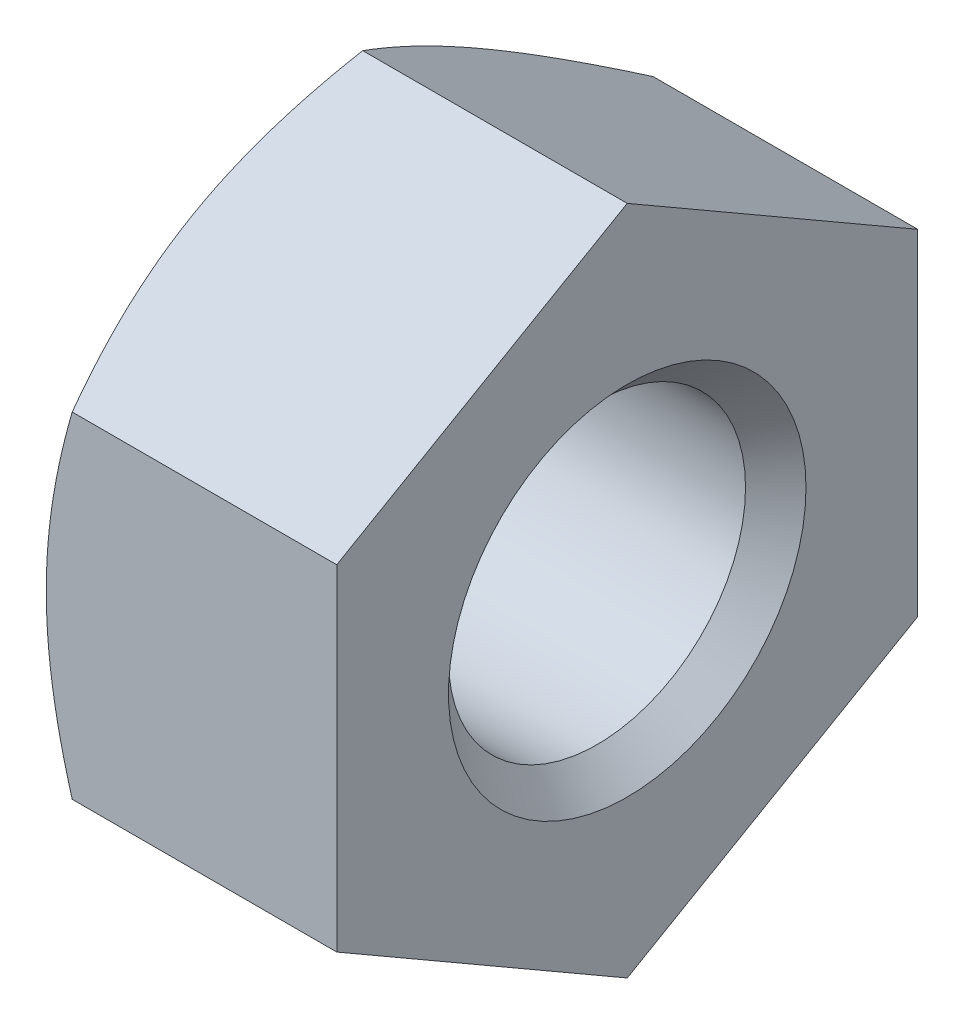
ISO-10303-21;
HEADER;
FILE_DESCRIPTION(('STEP AP214'),'2;1');
FILE_NAME('part.step','',(''),(''),'','','');
FILE_SCHEMA(('AUTOMOTIVE_DESIGN { 1 0 10303 214 1 1 1 1 }'));
ENDSEC;
DATA;
#1=APPLICATION_CONTEXT('core data for automotive mechanical design processes');
#2=APPLICATION_PROTOCOL_DEFINITION('international standard','automotive_design',2000,#1);
#3=PRODUCT_CONTEXT('',#1,'mechanical');
#4=PRODUCT('Part','Part','',(#3));
#5=PRODUCT_RELATED_PRODUCT_CATEGORY('part','',(#4));
#6=PRODUCT_DEFINITION_FORMATION('','',#4);
#7=PRODUCT_DEFINITION_CONTEXT('part definition',#1,'design');
#8=PRODUCT_DEFINITION('design','',#6,#7);
#9=PRODUCT_DEFINITION_SHAPE('','',#8);
#10=(LENGTH_UNIT() NAMED_UNIT(*) SI_UNIT(.MILLI.,.METRE.));
#11=(NAMED_UNIT(*) PLANE_ANGLE_UNIT() SI_UNIT($,.RADIAN.));
#12=(NAMED_UNIT(*) SI_UNIT($,.STERADIAN.) SOLID_ANGLE_UNIT());
#13=UNCERTAINTY_MEASURE_WITH_UNIT(LENGTH_MEASURE(1.E-05),#10,'distance_accuracy_value','');
#14=(GEOMETRIC_REPRESENTATION_CONTEXT(3) GLOBAL_UNCERTAINTY_ASSIGNED_CONTEXT((#13)) GLOBAL_UNIT_ASSIGNED_CONTEXT((#10,
#11,#12)) REPRESENTATION_CONTEXT('',''));
#15=CARTESIAN_POINT('',(0.,0.,0.));
#16=DIRECTION('',(0.,0.,1.));
#17=DIRECTION('',(1.,0.,0.));
#18=AXIS2_PLACEMENT_3D('',#15,#16,#17);
#19=CARTESIAN_POINT('',(8.5,-3.75277674973257,-6.5));
#20=DIRECTION('',(0.,0.,1.));
#21=DIRECTION('',(1.,0.,0.));
#22=AXIS2_PLACEMENT_3D('',#19,#20,#21);
#23=PLANE('',#22);
#24=CARTESIAN_POINT('',(-1.09282119696695E-11,0.,-6.5000000000021));
#25=CARTESIAN_POINT('',(-2.65652654537331E-05,-0.159284316480109,-6.50000000000076));
#26=CARTESIAN_POINT('',(0.00337972743862408,-0.318560959695347,-6.5000000000002));
#27=CARTESIAN_POINT('',(0.0168605822240665,-0.63680150419193,-6.4999999999998));
#28=CARTESIAN_POINT('',(0.0269338241987751,-0.79576546113901,-6.49999999999995));
#29=CARTESIAN_POINT('',(0.0534847991494171,-1.11235385212824,-6.50000000000005));
#30=CARTESIAN_POINT('',(0.0699302904864636,-1.26998101093723,-6.50000000000002));
#31=CARTESIAN_POINT('',(0.108872015365523,-1.58448433827285,-6.49999999999999));
#32=CARTESIAN_POINT('',(0.13136840817184,-1.7413604869217,-6.5));
#33=CARTESIAN_POINT('',(0.207238966047529,-2.21021215299385,-6.50000000000001));
#34=CARTESIAN_POINT('',(0.269031351182337,-2.52082563881242,-6.50000000000001));
#35=CARTESIAN_POINT('',(0.411540396382836,-3.13938147094162,-6.5));
#36=CARTESIAN_POINT('',(0.492351567542897,-3.44730224146836,-6.49999999999999));
#37=CARTESIAN_POINT('',(0.580556558563613,-3.75277666310649,-6.5));
#38=B_SPLINE_CURVE_WITH_KNOTS('',3,(#24,#25,#26,#27,#28,#29,#30,#31,#32,#33,#34,#35,#36,#37),
.UNSPECIFIED.,.F.,.F.,(4,2,2,2,2,2,4),(0.,0.477804183678231,0.955513786787722,1.4308372393377,
1.90617320398505,2.85559928787532,3.80984692116775),.UNSPECIFIED.);
#39=CARTESIAN_POINT('',(-4.85698309760928E-12,0.,-6.50000000000841));
#40=VERTEX_POINT('',#39);
#41=CARTESIAN_POINT('',(0.580556571067009,-3.75277670641953,-6.5));
#42=VERTEX_POINT('',#41);
#43=EDGE_CURVE('E202',#40,#42,#38,.T.);
#44=ORIENTED_EDGE('',*,*,#43,.F.);
#45=CARTESIAN_POINT('',(0.580556593192645,3.75277678306498,-6.5));
#46=CARTESIAN_POINT('',(0.49235159733905,3.4473023519739,-6.5));
#47=CARTESIAN_POINT('',(0.411540421570641,3.13938157184442,-6.5));
#48=CARTESIAN_POINT('',(0.269031368037173,2.52082572032325,-6.5));
#49=CARTESIAN_POINT('',(0.207238979169166,2.21021222471798,-6.5));
#50=CARTESIAN_POINT('',(0.131368416601329,1.74136054370656,-6.5));
#51=CARTESIAN_POINT('',(0.108872022380726,1.5844843900214,-6.5));
#52=CARTESIAN_POINT('',(0.069930295030884,1.26998105254583,-6.5));
#53=CARTESIAN_POINT('',(0.0534848026373018,1.11235388863321,-6.5));
#54=CARTESIAN_POINT('',(0.0269338259670412,0.795765487323537,-6.5));
#55=CARTESIAN_POINT('',(0.016860583332727,0.636801525159254,-6.5));
#56=CARTESIAN_POINT('',(0.00337972766151993,0.318560970195728,-6.5));
#57=CARTESIAN_POINT('',(-2.65652684605192E-05,0.159284321730737,-6.5));
#58=CARTESIAN_POINT('',(-9.71393821965785E-12,-3.50872316609123E-13,-6.5));
#59=B_SPLINE_CURVE_WITH_KNOTS('',3,(#45,#46,#47,#48,#49,#50,#51,#52,#53,#54,#55,#56,#57,#58),
.UNSPECIFIED.,.F.,.F.,(4,2,2,2,2,2,4),(0.,0.954247664608512,1.90367377943597,2.37900975963217,
2.85433322772826,3.33204284656971,3.80984704599525),.UNSPECIFIED.);
#60=CARTESIAN_POINT('',(0.580556571066926,3.75277677138924,-6.49999996248956));
#61=VERTEX_POINT('',#60);
#62=EDGE_CURVE('E151',#61,#40,#59,.T.);
#63=ORIENTED_EDGE('',*,*,#62,.F.);
#64=DIRECTION('',(1.,0.,0.));
#65=VECTOR('',#64,1.);
#66=CARTESIAN_POINT('',(8.5,3.75277674973257,-6.5));
#67=LINE('',#66,#65);
#68=CARTESIAN_POINT('',(6.5,3.75277674973257,-6.5));
#69=VERTEX_POINT('',#68);
#70=EDGE_CURVE('E98',#61,#69,#67,.T.);
#71=ORIENTED_EDGE('',*,*,#70,.T.);
#72=DIRECTION('',(0.,1.,0.));
#73=VECTOR('',#72,1.);
#74=CARTESIAN_POINT('',(6.5,9.1,-6.5));
#75=LINE('',#74,#73);
#76=CARTESIAN_POINT('',(6.5,-3.75277674973257,-6.5));
#77=VERTEX_POINT('',#76);
#78=EDGE_CURVE('E126',#69,#77,#75,.F.);
#79=ORIENTED_EDGE('',*,*,#78,.T.);
#80=DIRECTION('',(1.,0.,0.));
#81=VECTOR('',#80,1.);
#82=CARTESIAN_POINT('',(8.5,-3.75277674973256,-6.5));
#83=LINE('',#82,#81);
#84=EDGE_CURVE('E277',#77,#42,#83,.F.);
#85=ORIENTED_EDGE('',*,*,#84,.T.);
#86=EDGE_LOOP('',(#44,#63,#71,#79,#85));
#87=FACE_BOUND('',#86,.T.);
#88=ADVANCED_FACE('F18',(#87),#23,.F.);
#89=CARTESIAN_POINT('',(8.5,-7.50555349946513,0.));
#90=DIRECTION('',(0.,0.866025403784439,0.5));
#91=DIRECTION('',(0.,-0.5,0.866025403784439));
#92=AXIS2_PLACEMENT_3D('',#89,#90,#91);
#93=PLANE('',#92);
#94=CARTESIAN_POINT('',(-1.09314266979679E-11,-5.62916512460067,-3.25000000000105));
#95=CARTESIAN_POINT('',(-2.65652654571899E-05,-5.70880728284038,-3.11205573550273));
#96=CARTESIAN_POINT('',(0.00337972743869159,-5.78844560444835,-2.97411811624712));
#97=CARTESIAN_POINT('',(0.0168605822244118,-5.94756587669793,-2.69851372019583));
#98=CARTESIAN_POINT('',(0.0269338241993273,-6.02704785517242,-2.56084689519222));
#99=CARTESIAN_POINT('',(0.0534847991505099,-6.18534205066875,-2.28667330604956));
#100=CARTESIAN_POINT('',(0.0699302904878891,-6.26415563007401,-2.1501641821932));
#101=CARTESIAN_POINT('',(0.108872015367726,-6.42140729374339,-1.87779631114304));
#102=CARTESIAN_POINT('',(0.131368408174487,-6.49984536806862,-1.7419375811639));
#103=CARTESIAN_POINT('',(0.207238966051651,-6.73427120110705,-1.33590012773471));
#104=CARTESIAN_POINT('',(0.269031351187632,-6.88957794401787,-1.06690095825512));
#105=CARTESIAN_POINT('',(0.411540396390751,-7.19885586008551,-0.531215893966927));
#106=CARTESIAN_POINT('',(0.492351567552261,-7.35281624535039,-0.264548684335271));
#107=CARTESIAN_POINT('',(0.580556558574496,-7.50555345617095,-7.49877248903251E-08));
#108=B_SPLINE_CURVE_WITH_KNOTS('',3,(#94,#95,#96,#97,#98,#99,#100,#101,#102,#103,#104,#105,#106,
#107),.UNSPECIFIED.,.F.,.F.,(4,2,2,2,2,2,4),(0.,0.477804183683182,0.955513786797618,
1.43083723935248,1.90617320400472,2.85559928790472,3.80984692120699),.UNSPECIFIED.);
#109=CARTESIAN_POINT('',(-4.85826822472909E-12,-5.62916512460613,-3.25000000000421));
#110=VERTEX_POINT('',#109);
#111=CARTESIAN_POINT('',(0.580556571072286,-7.50555347781775,-3.74943592194856E-08));
#112=VERTEX_POINT('',#111);
#113=EDGE_CURVE('E86',#110,#112,#108,.T.);
#114=ORIENTED_EDGE('',*,*,#113,.F.);
#115=CARTESIAN_POINT('',(0.580556593192473,-3.75277673306665,-6.5000000288662));
#116=CARTESIAN_POINT('',(0.492351597338902,-3.90551394861217,-6.23545141133477));
#117=CARTESIAN_POINT('',(0.411540421570515,-4.05947433867689,-5.96878419338956));
#118=CARTESIAN_POINT('',(0.269031368037089,-4.36875226443742,-5.43309911231279));
#119=CARTESIAN_POINT('',(0.2072389791691,-4.52405901224003,-5.16409993436038));
#120=CARTESIAN_POINT('',(0.131368416601285,-4.75848485274571,-4.75806246799752));
#121=CARTESIAN_POINT('',(0.108872022380689,-4.83692292958827,-4.6222037336582));
#122=CARTESIAN_POINT('',(0.0699302950308591,-4.99417459832603,-4.34983585382941));
#123=CARTESIAN_POINT('',(0.0534848026372821,-5.07298818028233,-4.21332672555461));
#124=CARTESIAN_POINT('',(0.0269338259670299,-5.23128238093714,-3.93915312747697));
#125=CARTESIAN_POINT('',(0.0168605833327189,-5.31076436201927,-3.8014862979565));
#126=CARTESIAN_POINT('',(0.00337972766151615,-5.46988463950101,-3.52588189284367));
#127=CARTESIAN_POINT('',(-2.65652684631201E-05,-5.54952296373349,-3.38794426904337));
#128=CARTESIAN_POINT('',(-9.7162860636917E-12,-5.62916512459902,-3.2499999999997));
#129=B_SPLINE_CURVE_WITH_KNOTS('',3,(#115,#116,#117,#118,#119,#120,#121,#122,#123,#124,#125,
#126,#127,#128),.UNSPECIFIED.,.F.,.F.,(4,2,2,2,2,2,4),(0.,0.95424766460836,1.90367377943567,
2.37900975963179,2.8543332277278,3.33204284656917,3.80984704599463),.UNSPECIFIED.);
#130=EDGE_CURVE('E162',#42,#110,#129,.T.);
#131=ORIENTED_EDGE('',*,*,#130,.F.);
#132=ORIENTED_EDGE('',*,*,#84,.F.);
#133=DIRECTION('',(0.,-0.499999999999999,0.866025403784439));
#134=VECTOR('',#133,1.);
#135=CARTESIAN_POINT('',(6.5,-3.75277674973257,-6.5));
#136=LINE('',#135,#134);
#137=CARTESIAN_POINT('',(6.5,-7.50555349946513,0.));
#138=VERTEX_POINT('',#137);
#139=EDGE_CURVE('E292',#77,#138,#136,.T.);
#140=ORIENTED_EDGE('',*,*,#139,.T.);
#141=DIRECTION('',(1.,0.,0.));
#142=VECTOR('',#141,1.);
#143=CARTESIAN_POINT('',(8.5,-7.50555349946514,0.));
#144=LINE('',#143,#142);
#145=EDGE_CURVE('E273',#138,#112,#144,.F.);
#146=ORIENTED_EDGE('',*,*,#145,.T.);
#147=EDGE_LOOP('',(#114,#131,#132,#140,#146));
#148=FACE_BOUND('',#147,.T.);
#149=ADVANCED_FACE('F192',(#148),#93,.F.);
#150=CARTESIAN_POINT('',(8.5,-3.75277674973257,6.5));
#151=DIRECTION('',(0.,0.866025403784439,-0.5));
#152=DIRECTION('',(0.,0.5,0.866025403784439));
#153=AXIS2_PLACEMENT_3D('',#150,#151,#152);
#154=PLANE('',#153);
#155=CARTESIAN_POINT('',(-1.09269197541718E-11,-5.62916512460067,3.25000000000106));
#156=CARTESIAN_POINT('',(-2.65652654522853E-05,-5.54952296635947,3.38794426449657));
#157=CARTESIAN_POINT('',(0.00337972743862405,-5.46988464475138,3.52588188375017));
#158=CARTESIAN_POINT('',(0.0168605822240608,-5.31076437250277,3.80148627979815));
#159=CARTESIAN_POINT('',(0.0269338241987652,-5.23128239402938,3.93915310480046));
#160=CARTESIAN_POINT('',(0.0534847991493968,-5.07298819853489,4.21332669394037));
#161=CARTESIAN_POINT('',(0.0699302904864369,-4.99417461913038,4.34983581779527));
#162=CARTESIAN_POINT('',(0.108872015365481,-4.83692295546257,4.62220368884259));
#163=CARTESIAN_POINT('',(0.13136840817179,-4.75848488113817,4.75806241882034));
#164=CARTESIAN_POINT('',(0.207238966047451,-4.52405904810215,5.1640998722454));
#165=CARTESIAN_POINT('',(0.269031351182236,-4.36875230519289,5.43309904172227));
#166=CARTESIAN_POINT('',(0.411540396382685,-4.05947438912834,5.96878410600507));
#167=CARTESIAN_POINT('',(0.492351567542718,-3.905514003865,6.23545131563406));
#168=CARTESIAN_POINT('',(0.580556558563405,-3.75277679304597,6.49999992497899));
#169=B_SPLINE_CURVE_WITH_KNOTS('',3,(#155,#156,#157,#158,#159,#160,#161,#162,#163,#164,#165,
#166,#167,#168),.UNSPECIFIED.,.F.,.F.,(4,2,2,2,2,2,4),(0.,0.477804183678136,0.955513786787531,
1.43083723933742,1.90617320398467,2.85559928787475,3.80984692116699),.UNSPECIFIED.);
#170=CARTESIAN_POINT('',(-4.85667693640149E-12,-5.62916512460613,3.25000000000421));
#171=VERTEX_POINT('',#170);
#172=CARTESIAN_POINT('',(0.580556571066906,-3.75277677138927,6.4999999624895));
#173=VERTEX_POINT('',#172);
#174=EDGE_CURVE('E82',#171,#173,#169,.T.);
#175=ORIENTED_EDGE('',*,*,#174,.F.);
#176=CARTESIAN_POINT('',(0.580556593194509,-7.50555351613457,-2.88723034796803E-08));
#177=CARTESIAN_POINT('',(0.492351597340654,-7.35281630058878,0.264548588659608));
#178=CARTESIAN_POINT('',(0.411540421571996,-7.19885591052378,0.531215806605311));
#179=CARTESIAN_POINT('',(0.26903136803808,-6.88957798476267,1.06690088768306));
#180=CARTESIAN_POINT('',(0.207238979169872,-6.73427123695977,1.33590006563597));
#181=CARTESIAN_POINT('',(0.131368416601783,-6.49984539645366,1.7419375319996));
#182=CARTESIAN_POINT('',(0.108872022381103,-6.42140731961095,1.87779626633917));
#183=CARTESIAN_POINT('',(0.0699302950311286,-6.26415565087289,2.15016414616847));
#184=CARTESIAN_POINT('',(0.0534848026374896,-6.18534206891644,2.28667327444353));
#185=CARTESIAN_POINT('',(0.0269338259671367,-6.02704786826132,2.5608468725217));
#186=CARTESIAN_POINT('',(0.0168605833327872,-5.94756588717904,2.69851370204244));
#187=CARTESIAN_POINT('',(0.00337972766153246,-5.788445609697,2.9741181071558));
#188=CARTESIAN_POINT('',(-2.65652684601394E-05,-5.70880728546436,3.11205573095637));
#189=CARTESIAN_POINT('',(-9.71335387280296E-12,-5.62916512459867,3.25000000000031));
#190=B_SPLINE_CURVE_WITH_KNOTS('',3,(#176,#177,#178,#179,#180,#181,#182,#183,#184,#185,#186,
#187,#188,#189),.UNSPECIFIED.,.F.,.F.,(4,2,2,2,2,2,4),(0.,0.954247664610198,1.90367377943932,
2.37900975963636,2.85433322773328,3.33204284657558,3.80984704600197),.UNSPECIFIED.);
#191=EDGE_CURVE('E198',#112,#171,#190,.T.);
#192=ORIENTED_EDGE('',*,*,#191,.F.);
#193=ORIENTED_EDGE('',*,*,#145,.F.);
#194=DIRECTION('',(0.,0.499999999999999,0.866025403784439));
#195=VECTOR('',#194,1.);
#196=CARTESIAN_POINT('',(6.5,-7.50555349946513,0.));
#197=LINE('',#196,#195);
#198=CARTESIAN_POINT('',(6.5,-3.75277674973257,6.5));
#199=VERTEX_POINT('',#198);
#200=EDGE_CURVE('E271',#138,#199,#197,.T.);
#201=ORIENTED_EDGE('',*,*,#200,.T.);
#202=DIRECTION('',(-1.,0.,0.));
#203=VECTOR('',#202,1.);
#204=CARTESIAN_POINT('',(8.5,-3.75277674973257,6.5));
#205=LINE('',#204,#203);
#206=EDGE_CURVE('E268',#199,#173,#205,.T.);
#207=ORIENTED_EDGE('',*,*,#206,.T.);
#208=EDGE_LOOP('',(#175,#192,#193,#201,#207));
#209=FACE_BOUND('',#208,.T.);
#210=ADVANCED_FACE('F189',(#209),#154,.F.);
#211=CARTESIAN_POINT('',(8.5,3.75277674973257,6.5));
#212=DIRECTION('',(0.,0.,-1.));
#213=DIRECTION('',(-1.,0.,0.));
#214=AXIS2_PLACEMENT_3D('',#211,#212,#213);
#215=PLANE('',#214);
#216=CARTESIAN_POINT('',(-1.09282119696695E-11,0.,6.5000000000021));
#217=CARTESIAN_POINT('',(-2.65652654538492E-05,0.15928431648001,6.50000000000076));
#218=CARTESIAN_POINT('',(0.00337972743861955,0.318560959695149,6.5000000000002));
#219=CARTESIAN_POINT('',(0.016860582224045,0.636801504191534,6.4999999999998));
#220=CARTESIAN_POINT('',(0.0269338241987413,0.795765461138516,6.49999999999995));
#221=CARTESIAN_POINT('',(0.0534847991493509,1.11235385212755,6.50000000000005));
#222=CARTESIAN_POINT('',(0.0699302904863776,1.26998101093644,6.50000000000002));
#223=CARTESIAN_POINT('',(0.10887201536539,1.58448433827188,6.49999999999999));
#224=CARTESIAN_POINT('',(0.131368408171681,1.74136048692063,6.5));
#225=CARTESIAN_POINT('',(0.207238966047282,2.2102121529925,6.50000000000001));
#226=CARTESIAN_POINT('',(0.269031351182019,2.52082563881088,6.50000000000001));
#227=CARTESIAN_POINT('',(0.411540396382361,3.13938147093971,6.5));
#228=CARTESIAN_POINT('',(0.492351567542335,3.44730224146628,6.49999999999999));
#229=CARTESIAN_POINT('',(0.580556558562959,3.75277666310423,6.5));
#230=B_SPLINE_CURVE_WITH_KNOTS('',3,(#216,#217,#218,#219,#220,#221,#222,#223,#224,#225,#226,
#227,#228,#229),.UNSPECIFIED.,.F.,.F.,(4,2,2,2,2,2,4),(0.,0.477804183677934,0.955513786787128,
1.43083723933681,1.90617320398387,2.85559928787356,3.80984692116539),.UNSPECIFIED.);
#231=CARTESIAN_POINT('',(-4.85698309760928E-12,0.,6.50000000000841));
#232=VERTEX_POINT('',#231);
#233=CARTESIAN_POINT('',(0.580556571066774,3.75277670641871,6.5));
#234=VERTEX_POINT('',#233);
#235=EDGE_CURVE('E22',#232,#234,#230,.T.);
#236=ORIENTED_EDGE('',*,*,#235,.F.);
#237=CARTESIAN_POINT('',(0.580556593192685,-3.75277678306512,6.5));
#238=CARTESIAN_POINT('',(0.492351597339085,-3.44730235197403,6.5));
#239=CARTESIAN_POINT('',(0.41154042157067,-3.13938157184454,6.5));
#240=CARTESIAN_POINT('',(0.269031368037193,-2.52082572032334,6.5));
#241=CARTESIAN_POINT('',(0.207238979169182,-2.21021222471806,6.5));
#242=CARTESIAN_POINT('',(0.131368416601339,-1.74136054370662,6.5));
#243=CARTESIAN_POINT('',(0.108872022380734,-1.58448439002146,6.5));
#244=CARTESIAN_POINT('',(0.069930295030889,-1.26998105254588,6.5));
#245=CARTESIAN_POINT('',(0.0534848026373056,-1.11235388863325,6.5));
#246=CARTESIAN_POINT('',(0.0269338259670432,-0.795765487323567,6.5));
#247=CARTESIAN_POINT('',(0.0168605833327284,-0.636801525159277,6.5));
#248=CARTESIAN_POINT('',(0.00337972766152036,-0.318560970195739,6.5));
#249=CARTESIAN_POINT('',(-2.65652684603681E-05,-0.159284321730742,6.5));
#250=CARTESIAN_POINT('',(-9.71399645317338E-12,3.51718926058685E-13,6.5));
#251=B_SPLINE_CURVE_WITH_KNOTS('',3,(#237,#238,#239,#240,#241,#242,#243,#244,#245,#246,#247,
#248,#249,#250),.UNSPECIFIED.,.F.,.F.,(4,2,2,2,2,2,4),(0.,0.954247664608549,1.90367377943605,
2.37900975963226,2.85433322772837,3.33204284656984,3.80984704599539),.UNSPECIFIED.);
#252=EDGE_CURVE('E76',#173,#232,#251,.T.);
#253=ORIENTED_EDGE('',*,*,#252,.F.);
#254=ORIENTED_EDGE('',*,*,#206,.F.);
#255=DIRECTION('',(0.,1.,0.));
#256=VECTOR('',#255,1.);
#257=CARTESIAN_POINT('',(6.5,9.1,6.5));
#258=LINE('',#257,#256);
#259=CARTESIAN_POINT('',(6.5,3.75277674973257,6.5));
#260=VERTEX_POINT('',#259);
#261=EDGE_CURVE('E299',#199,#260,#258,.T.);
#262=ORIENTED_EDGE('',*,*,#261,.T.);
#263=DIRECTION('',(1.,0.,0.));
#264=VECTOR('',#263,1.);
#265=CARTESIAN_POINT('',(8.5,3.75277674973256,6.5));
#266=LINE('',#265,#264);
#267=EDGE_CURVE('E93',#260,#234,#266,.F.);
#268=ORIENTED_EDGE('',*,*,#267,.T.);
#269=EDGE_LOOP('',(#236,#253,#254,#262,#268));
#270=FACE_BOUND('',#269,.T.);
#271=ADVANCED_FACE('F90',(#270),#215,.F.);
#272=CARTESIAN_POINT('',(8.5,7.50555349946513,0.));
#273=DIRECTION('',(0.,-0.866025403784439,-0.5));
#274=DIRECTION('',(0.,0.5,-0.866025403784439));
#275=AXIS2_PLACEMENT_3D('',#272,#273,#274);
#276=PLANE('',#275);
#277=CARTESIAN_POINT('',(-1.09316144872928E-11,5.62916512460067,3.25000000000105));
#278=CARTESIAN_POINT('',(-2.65652688950295E-05,5.70880728546523,3.11205573095636));
#279=CARTESIAN_POINT('',(0.00337972766142582,5.78844560969744,2.97411810715543));
#280=CARTESIAN_POINT('',(0.0168605833329407,5.94756588717923,2.69851370204169));
#281=CARTESIAN_POINT('',(0.0269338259672226,6.0270478682617,2.56084687252093));
#282=CARTESIAN_POINT('',(0.0534848026375586,6.18534206891702,2.28667327444262));
#283=CARTESIAN_POINT('',(0.069930295031248,6.26415565087349,2.15016414616744));
#284=CARTESIAN_POINT('',(0.108872022381303,6.42140731961164,1.87779626633792));
#285=CARTESIAN_POINT('',(0.131368416602011,6.49984539645442,1.74193753199826));
#286=CARTESIAN_POINT('',(0.20723897917021,6.73427123696072,1.33590006563433));
#287=CARTESIAN_POINT('',(0.269031368038517,6.88957798476374,1.06690088768121));
#288=CARTESIAN_POINT('',(0.411540421572649,7.19885591052507,0.531215806603046));
#289=CARTESIAN_POINT('',(0.492351597341422,7.35281630059018,0.264548588657145));
#290=CARTESIAN_POINT('',(0.580556593195388,7.50555351613609,-2.88749519049605E-08));
#291=B_SPLINE_CURVE_WITH_KNOTS('',3,(#277,#278,#279,#280,#281,#282,#283,#284,#285,#286,#287,
#288,#289,#290),.UNSPECIFIED.,.F.,.F.,(4,2,2,2,2,2,4),(0.,0.477804199426692,0.955513818269322,
1.4308372863666,1.90617326656399,2.85559938139388,3.80984704600482),.UNSPECIFIED.);
#292=CARTESIAN_POINT('',(-4.85833870916522E-12,5.62916512460613,3.25000000000421));
#293=VERTEX_POINT('',#292);
#294=CARTESIAN_POINT('',(0.580556588382897,7.50555350780061,-1.44374769454428E-08));
#295=VERTEX_POINT('',#294);
#296=EDGE_CURVE('E119',#293,#295,#291,.T.);
#297=ORIENTED_EDGE('',*,*,#296,.F.);
#298=CARTESIAN_POINT('',(0.580556593192945,3.75277673306584,6.50000002886762));
#299=CARTESIAN_POINT('',(0.492351597339307,3.90551394861142,6.23545141133608));
#300=CARTESIAN_POINT('',(0.411540421570858,4.0594743386762,5.96878419339075));
#301=CARTESIAN_POINT('',(0.269031368037318,4.36875226443687,5.43309911231375));
#302=CARTESIAN_POINT('',(0.207238979169278,4.52405901223955,5.16409993436123));
#303=CARTESIAN_POINT('',(0.1313684166014,4.75848485274532,4.75806246799819));
#304=CARTESIAN_POINT('',(0.108872022380784,4.83692292958792,4.62220373365881));
#305=CARTESIAN_POINT('',(0.0699302950309209,4.99417459832575,4.3498358538299));
#306=CARTESIAN_POINT('',(0.0534848026373294,5.07298818028208,4.21332672555504));
#307=CARTESIAN_POINT('',(0.0269338259670539,5.23128238093696,3.93915312747728));
#308=CARTESIAN_POINT('',(0.0168605833327343,5.31076436201913,3.80148629795675));
#309=CARTESIAN_POINT('',(0.0033797276615198,5.46988463950094,3.5258818928438));
#310=CARTESIAN_POINT('',(-2.65652684625761E-05,5.54952296373346,3.38794426904343));
#311=CARTESIAN_POINT('',(-9.71630183968075E-12,5.62916512459902,3.2499999999997));
#312=B_SPLINE_CURVE_WITH_KNOTS('',3,(#298,#299,#300,#301,#302,#303,#304,#305,#306,#307,#308,
#309,#310,#311),.UNSPECIFIED.,.F.,.F.,(4,2,2,2,2,2,4),(0.,0.954247664608785,1.90367377943651,
2.37900975963285,2.85433322772907,3.33204284657066,3.80984704599633),.UNSPECIFIED.);
#313=EDGE_CURVE('E97',#234,#293,#312,.T.);
#314=ORIENTED_EDGE('',*,*,#313,.F.);
#315=ORIENTED_EDGE('',*,*,#267,.F.);
#316=DIRECTION('',(0.,0.499999999999999,-0.866025403784439));
#317=VECTOR('',#316,1.);
#318=CARTESIAN_POINT('',(6.5,3.75277674973257,6.5));
#319=LINE('',#318,#317);
#320=CARTESIAN_POINT('',(6.5,7.50555349946513,0.));
#321=VERTEX_POINT('',#320);
#322=EDGE_CURVE('E115',#260,#321,#319,.T.);
#323=ORIENTED_EDGE('',*,*,#322,.T.);
#324=DIRECTION('',(1.,0.,0.));
#325=VECTOR('',#324,1.);
#326=CARTESIAN_POINT('',(8.5,7.50555349946514,0.));
#327=LINE('',#326,#325);
#328=EDGE_CURVE('E275',#321,#295,#327,.F.);
#329=ORIENTED_EDGE('',*,*,#328,.T.);
#330=EDGE_LOOP('',(#297,#314,#315,#323,#329));
#331=FACE_BOUND('',#330,.T.);
#332=ADVANCED_FACE('F132',(#331),#276,.F.);
#333=CARTESIAN_POINT('',(8.5,3.75277674973257,-6.5));
#334=DIRECTION('',(0.,-0.866025403784439,0.5));
#335=DIRECTION('',(0.,-0.5,-0.866025403784439));
#336=AXIS2_PLACEMENT_3D('',#333,#334,#335);
#337=PLANE('',#336);
#338=CARTESIAN_POINT('',(-1.09271075434967E-11,5.62916512460067,-3.25000000000105));
#339=CARTESIAN_POINT('',(-2.65652654524232E-05,5.54952296635946,-3.38794426449657));
#340=CARTESIAN_POINT('',(0.0033797274386241,5.46988464475138,-3.52588188375018));
#341=CARTESIAN_POINT('',(0.0168605822240616,5.31076437250276,-3.80148627979816));
#342=CARTESIAN_POINT('',(0.0269338241987668,5.23128239402936,-3.93915310480048));
#343=CARTESIAN_POINT('',(0.0534847991494002,5.07298819853487,-4.2133266939404));
#344=CARTESIAN_POINT('',(0.0699302904864415,4.99417461913036,-4.34983581779531));
#345=CARTESIAN_POINT('',(0.108872015365489,4.83692295546254,-4.62220368884264));
#346=CARTESIAN_POINT('',(0.1313684081718,4.75848488113814,-4.75806241882039));
#347=CARTESIAN_POINT('',(0.207238966047466,4.52405904810211,-5.16409987224547));
#348=CARTESIAN_POINT('',(0.269031351182255,4.36875230519285,-5.43309904172235));
#349=CARTESIAN_POINT('',(0.411540396382714,4.05947438912829,-5.96878410600517));
#350=CARTESIAN_POINT('',(0.492351567542753,3.90551400386493,-6.23545131563417));
#351=CARTESIAN_POINT('',(0.580556558563445,3.7527767930459,-6.49999992497911));
#352=B_SPLINE_CURVE_WITH_KNOTS('',3,(#338,#339,#340,#341,#342,#343,#344,#345,#346,#347,#348,
#349,#350,#351),.UNSPECIFIED.,.F.,.F.,(4,2,2,2,2,2,4),(0.,0.477804183678154,0.955513786787567,
1.43083723933747,1.90617320398475,2.85559928787487,3.80984692116714),.UNSPECIFIED.);
#353=CARTESIAN_POINT('',(-4.85677474118416E-12,5.62916512460614,-3.25000000000421));
#354=VERTEX_POINT('',#353);
#355=EDGE_CURVE('E156',#354,#61,#352,.T.);
#356=ORIENTED_EDGE('',*,*,#355,.F.);
#357=CARTESIAN_POINT('',(0.580556558568727,7.50555345617604,-7.49940007325858E-08));
#358=CARTESIAN_POINT('',(0.492351567549649,7.35281624535103,-0.264548684339458));
#359=CARTESIAN_POINT('',(0.411540396389493,7.19885586008449,-0.53121589397009));
#360=CARTESIAN_POINT('',(0.269031351187508,6.8895779440159,-1.06690095825717));
#361=CARTESIAN_POINT('',(0.207238966051315,6.73427120110578,-1.33590012773666));
#362=CARTESIAN_POINT('',(0.131368408174177,6.49984536806777,-1.74193758116552));
#363=CARTESIAN_POINT('',(0.108872015367478,6.42140729374258,-1.87779631114453));
#364=CARTESIAN_POINT('',(0.0699302904877519,6.26415563007326,-2.15016418219445));
#365=CARTESIAN_POINT('',(0.0534847991504196,6.18534205066804,-2.28667330605068));
#366=CARTESIAN_POINT('',(0.0269338241992241,6.02704785517195,-2.56084689519317));
#367=CARTESIAN_POINT('',(0.0168605822242477,5.94756587669766,-2.69851372019673));
#368=CARTESIAN_POINT('',(0.00337972743879828,5.78844560444786,-2.97411811624756));
#369=CARTESIAN_POINT('',(-2.65652650188118E-05,5.70880728283949,-3.11205573550277));
#370=CARTESIAN_POINT('',(-9.7135494823683E-12,5.62916512459868,-3.2500000000003));
#371=B_SPLINE_CURVE_WITH_KNOTS('',3,(#357,#358,#359,#360,#361,#362,#363,#364,#365,#366,#367,
#368,#369,#370),.UNSPECIFIED.,.F.,.F.,(4,2,2,2,2,2,4),(0.,0.954247633301081,1.9036737172,
2.37900968185184,2.85433313440632,3.33204273752032,3.80984692120306),.UNSPECIFIED.);
#372=EDGE_CURVE('E42',#295,#354,#371,.T.);
#373=ORIENTED_EDGE('',*,*,#372,.F.);
#374=ORIENTED_EDGE('',*,*,#328,.F.);
#375=DIRECTION('',(0.,-0.499999999999999,-0.866025403784439));
#376=VECTOR('',#375,1.);
#377=CARTESIAN_POINT('',(6.5,7.50555349946513,0.));
#378=LINE('',#377,#376);
#379=EDGE_CURVE('E112',#321,#69,#378,.T.);
#380=ORIENTED_EDGE('',*,*,#379,.T.);
#381=ORIENTED_EDGE('',*,*,#70,.F.);
#382=EDGE_LOOP('',(#356,#373,#374,#380,#381));
#383=FACE_BOUND('',#382,.T.);
#384=ADVANCED_FACE('F167',(#383),#337,.F.);
#385=CARTESIAN_POINT('',(0.584039923126056,0.,0.));
#386=DIRECTION('',(1.,0.,0.));
#387=DIRECTION('',(0.,0.,-1.));
#388=AXIS2_PLACEMENT_3D('',#385,#386,#387);
#389=CONICAL_SURFACE('',#388,7.51158682055575,1.047197551212);
#390=ORIENTED_EDGE('',*,*,#313,.T.);
#391=CARTESIAN_POINT('',(0.,0.,0.));
#392=DIRECTION('',(1.,0.,0.));
#393=DIRECTION('',(0.,0.,-1.));
#394=AXIS2_PLACEMENT_3D('',#391,#392,#393);
#395=CIRCLE('',#394,6.50000000001683);
#396=EDGE_CURVE('E105',#293,#232,#395,.T.);
#397=ORIENTED_EDGE('',*,*,#396,.T.);
#398=ORIENTED_EDGE('',*,*,#235,.T.);
#399=EDGE_LOOP('',(#390,#397,#398));
#400=FACE_BOUND('',#399,.T.);
#401=ADVANCED_FACE('F111',(#400),#389,.T.);
#402=CARTESIAN_POINT('',(0.584039923126056,0.,0.));
#403=DIRECTION('',(1.,0.,0.));
#404=DIRECTION('',(0.,0.,-1.));
#405=AXIS2_PLACEMENT_3D('',#402,#403,#404);
#406=CONICAL_SURFACE('',#405,7.51158682055575,1.047197551212);
#407=ORIENTED_EDGE('',*,*,#174,.T.);
#408=ORIENTED_EDGE('',*,*,#252,.T.);
#409=CARTESIAN_POINT('',(0.,0.,0.));
#410=DIRECTION('',(1.,0.,0.));
#411=DIRECTION('',(0.,0.,-1.));
#412=AXIS2_PLACEMENT_3D('',#409,#410,#411);
#413=CIRCLE('',#412,6.50000000001683);
#414=EDGE_CURVE('E80',#232,#171,#413,.T.);
#415=ORIENTED_EDGE('',*,*,#414,.T.);
#416=EDGE_LOOP('',(#407,#408,#415));
#417=FACE_BOUND('',#416,.T.);
#418=ADVANCED_FACE('F78',(#417),#406,.T.);
#419=CARTESIAN_POINT('',(0.584039923126056,0.,0.));
#420=DIRECTION('',(1.,0.,0.));
#421=DIRECTION('',(0.,0.,-1.));
#422=AXIS2_PLACEMENT_3D('',#419,#420,#421);
#423=CONICAL_SURFACE('',#422,7.51158682055575,1.047197551212);
#424=ORIENTED_EDGE('',*,*,#113,.T.);
#425=ORIENTED_EDGE('',*,*,#191,.T.);
#426=CARTESIAN_POINT('',(0.,0.,0.));
#427=DIRECTION('',(1.,0.,0.));
#428=DIRECTION('',(0.,0.,-1.));
#429=AXIS2_PLACEMENT_3D('',#426,#427,#428);
#430=CIRCLE('',#429,6.50000000001683);
#431=EDGE_CURVE('E109',#171,#110,#430,.T.);
#432=ORIENTED_EDGE('',*,*,#431,.T.);
#433=EDGE_LOOP('',(#424,#425,#432));
#434=FACE_BOUND('',#433,.T.);
#435=ADVANCED_FACE('F209',(#434),#423,.T.);
#436=CARTESIAN_POINT('',(0.584039923126056,0.,0.));
#437=DIRECTION('',(1.,0.,0.));
#438=DIRECTION('',(0.,0.,-1.));
#439=AXIS2_PLACEMENT_3D('',#436,#437,#438);
#440=CONICAL_SURFACE('',#439,7.51158682055575,1.047197551212);
#441=ORIENTED_EDGE('',*,*,#43,.T.);
#442=ORIENTED_EDGE('',*,*,#130,.T.);
#443=CARTESIAN_POINT('',(0.,0.,0.));
#444=DIRECTION('',(1.,0.,0.));
#445=DIRECTION('',(0.,0.,-1.));
#446=AXIS2_PLACEMENT_3D('',#443,#444,#445);
#447=CIRCLE('',#446,6.50000000001683);
#448=EDGE_CURVE('E261',#110,#40,#447,.T.);
#449=ORIENTED_EDGE('',*,*,#448,.T.);
#450=EDGE_LOOP('',(#441,#442,#449));
#451=FACE_BOUND('',#450,.T.);
#452=ADVANCED_FACE('F146',(#451),#440,.T.);
#453=CARTESIAN_POINT('',(0.584039923126056,0.,0.));
#454=DIRECTION('',(1.,0.,0.));
#455=DIRECTION('',(0.,0.,-1.));
#456=AXIS2_PLACEMENT_3D('',#453,#454,#455);
#457=CONICAL_SURFACE('',#456,7.51158682055575,1.047197551212);
#458=ORIENTED_EDGE('',*,*,#355,.T.);
#459=ORIENTED_EDGE('',*,*,#62,.T.);
#460=CARTESIAN_POINT('',(0.,0.,0.));
#461=DIRECTION('',(1.,0.,0.));
#462=DIRECTION('',(0.,0.,-1.));
#463=AXIS2_PLACEMENT_3D('',#460,#461,#462);
#464=CIRCLE('',#463,6.50000000001683);
#465=EDGE_CURVE('E258',#40,#354,#464,.T.);
#466=ORIENTED_EDGE('',*,*,#465,.T.);
#467=EDGE_LOOP('',(#458,#459,#466));
#468=FACE_BOUND('',#467,.T.);
#469=ADVANCED_FACE('F140',(#468),#457,.T.);
#470=CARTESIAN_POINT('',(0.584039923126056,0.,0.));
#471=DIRECTION('',(1.,0.,0.));
#472=DIRECTION('',(0.,0.,-1.));
#473=AXIS2_PLACEMENT_3D('',#470,#471,#472);
#474=CONICAL_SURFACE('',#473,7.51158682055575,1.047197551212);
#475=CARTESIAN_POINT('',(0.,0.,0.));
#476=DIRECTION('',(1.,0.,0.));
#477=DIRECTION('',(0.,0.,-1.));
#478=AXIS2_PLACEMENT_3D('',#475,#476,#477);
#479=CIRCLE('',#478,6.50000000001683);
#480=EDGE_CURVE('E251',#354,#293,#479,.T.);
#481=ORIENTED_EDGE('',*,*,#480,.T.);
#482=ORIENTED_EDGE('',*,*,#296,.T.);
#483=ORIENTED_EDGE('',*,*,#372,.T.);
#484=EDGE_LOOP('',(#481,#482,#483));
#485=FACE_BOUND('',#484,.T.);
#486=ADVANCED_FACE('F134',(#485),#474,.T.);
#487=CARTESIAN_POINT('',(6.5,9.1,0.));
#488=DIRECTION('',(-1.,0.,0.));
#489=DIRECTION('',(0.,0.,1.));
#490=AXIS2_PLACEMENT_3D('',#487,#488,#489);
#491=PLANE('',#490);
#492=ORIENTED_EDGE('',*,*,#322,.F.);
#493=ORIENTED_EDGE('',*,*,#261,.F.);
#494=ORIENTED_EDGE('',*,*,#200,.F.);
#495=ORIENTED_EDGE('',*,*,#139,.F.);
#496=ORIENTED_EDGE('',*,*,#78,.F.);
#497=ORIENTED_EDGE('',*,*,#379,.F.);
#498=EDGE_LOOP('',(#492,#493,#494,#495,#496,#497));
#499=FACE_BOUND('',#498,.T.);
#500=CARTESIAN_POINT('',(6.49999999995998,0.,0.));
#501=DIRECTION('',(1.,0.,0.));
#502=DIRECTION('',(0.,0.,-1.));
#503=AXIS2_PLACEMENT_3D('',#500,#501,#502);
#504=CIRCLE('',#503,3.99999999996226);
#505=CARTESIAN_POINT('',(6.49999999995998,0.,-3.99999999996226));
#506=VERTEX_POINT('',#505);
#507=EDGE_CURVE('E245',#506,#506,#504,.F.);
#508=ORIENTED_EDGE('',*,*,#507,.T.);
#509=EDGE_LOOP('',(#508));
#510=FACE_BOUND('',#509,.T.);
#511=ADVANCED_FACE('F139',(#499,#510),#491,.F.);
#512=CARTESIAN_POINT('',(0.,0.,0.));
#513=DIRECTION('',(1.,0.,0.));
#514=DIRECTION('',(0.,0.,-1.));
#515=AXIS2_PLACEMENT_3D('',#512,#513,#514);
#516=PLANE('',#515);
#517=CARTESIAN_POINT('',(-5.6843418860808E-11,0.,0.));
#518=DIRECTION('',(-1.,0.,0.));
#519=DIRECTION('',(0.,0.,1.));
#520=AXIS2_PLACEMENT_3D('',#517,#518,#519);
#521=CIRCLE('',#520,4.0000000000191);
#522=CARTESIAN_POINT('',(-5.6843418860808E-11,0.,4.0000000000191));
#523=VERTEX_POINT('',#522);
#524=EDGE_CURVE('E244',#523,#523,#521,.F.);
#525=ORIENTED_EDGE('',*,*,#524,.T.);
#526=EDGE_LOOP('',(#525));
#527=FACE_BOUND('',#526,.T.);
#528=ORIENTED_EDGE('',*,*,#465,.F.);
#529=ORIENTED_EDGE('',*,*,#448,.F.);
#530=ORIENTED_EDGE('',*,*,#431,.F.);
#531=ORIENTED_EDGE('',*,*,#414,.F.);
#532=ORIENTED_EDGE('',*,*,#396,.F.);
#533=ORIENTED_EDGE('',*,*,#480,.F.);
#534=EDGE_LOOP('',(#528,#529,#530,#531,#532,#533));
#535=FACE_BOUND('',#534,.T.);
#536=ADVANCED_FACE('F103',(#527,#535),#516,.F.);
#537=CARTESIAN_POINT('',(6.49999999995998,0.,0.));
#538=DIRECTION('',(1.,0.,0.));
#539=DIRECTION('',(0.,0.,-1.));
#540=AXIS2_PLACEMENT_3D('',#537,#538,#539);
#541=CONICAL_SURFACE('',#540,3.99999999996226,0.785398163397448);
#542=CARTESIAN_POINT('',(5.8235,0.,0.));
#543=DIRECTION('',(-1.,0.,0.));
#544=DIRECTION('',(0.,0.,1.));
#545=AXIS2_PLACEMENT_3D('',#542,#543,#544);
#546=CIRCLE('',#545,3.3235);
#547=CARTESIAN_POINT('',(5.8235,0.,3.3235));
#548=VERTEX_POINT('',#547);
#549=EDGE_CURVE('E33',#548,#548,#546,.T.);
#550=ORIENTED_EDGE('',*,*,#549,.T.);
#551=EDGE_LOOP('',(#550));
#552=FACE_BOUND('',#551,.T.);
#553=ORIENTED_EDGE('',*,*,#507,.F.);
#554=EDGE_LOOP('',(#553));
#555=FACE_BOUND('',#554,.T.);
#556=ADVANCED_FACE('F228',(#552,#555),#541,.F.);
#557=CARTESIAN_POINT('',(-5.6843418860808E-11,0.,0.));
#558=DIRECTION('',(-1.,0.,0.));
#559=DIRECTION('',(0.,0.,1.));
#560=AXIS2_PLACEMENT_3D('',#557,#558,#559);
#561=CONICAL_SURFACE('',#560,4.0000000000191,0.785398163397448);
#562=ORIENTED_EDGE('',*,*,#524,.F.);
#563=EDGE_LOOP('',(#562));
#564=FACE_BOUND('',#563,.T.);
#565=CARTESIAN_POINT('',(0.6765,0.,0.));
#566=DIRECTION('',(-1.,0.,0.));
#567=DIRECTION('',(0.,0.,1.));
#568=AXIS2_PLACEMENT_3D('',#565,#566,#567);
#569=CIRCLE('',#568,3.3235);
#570=CARTESIAN_POINT('',(0.6765,0.,3.3235));
#571=VERTEX_POINT('',#570);
#572=EDGE_CURVE('E11',#571,#571,#569,.F.);
#573=ORIENTED_EDGE('',*,*,#572,.T.);
#574=EDGE_LOOP('',(#573));
#575=FACE_BOUND('',#574,.T.);
#576=ADVANCED_FACE('F222',(#564,#575),#561,.F.);
#577=CARTESIAN_POINT('',(6.5,0.,0.));
#578=DIRECTION('',(-1.,0.,0.));
#579=DIRECTION('',(0.,0.,1.));
#580=AXIS2_PLACEMENT_3D('',#577,#578,#579);
#581=CYLINDRICAL_SURFACE('',#580,3.3235);
#582=ORIENTED_EDGE('',*,*,#572,.F.);
#583=EDGE_LOOP('',(#582));
#584=FACE_BOUND('',#583,.T.);
#585=ORIENTED_EDGE('',*,*,#549,.F.);
#586=EDGE_LOOP('',(#585));
#587=FACE_BOUND('',#586,.T.);
#588=ADVANCED_FACE('F220',(#584,#587),#581,.F.);
#589=CLOSED_SHELL('',(#88,#149,#210,#271,#332,#384,#401,#418,#435,#452,#469,#486,#511,#536,#556,
#576,#588));
#590=MANIFOLD_SOLID_BREP('B1',#589);
#591=ADVANCED_BREP_SHAPE_REPRESENTATION('',(#18,#590),#14);
#592=SHAPE_DEFINITION_REPRESENTATION(#9,#591);
ENDSEC;
END-ISO-10303-21;
